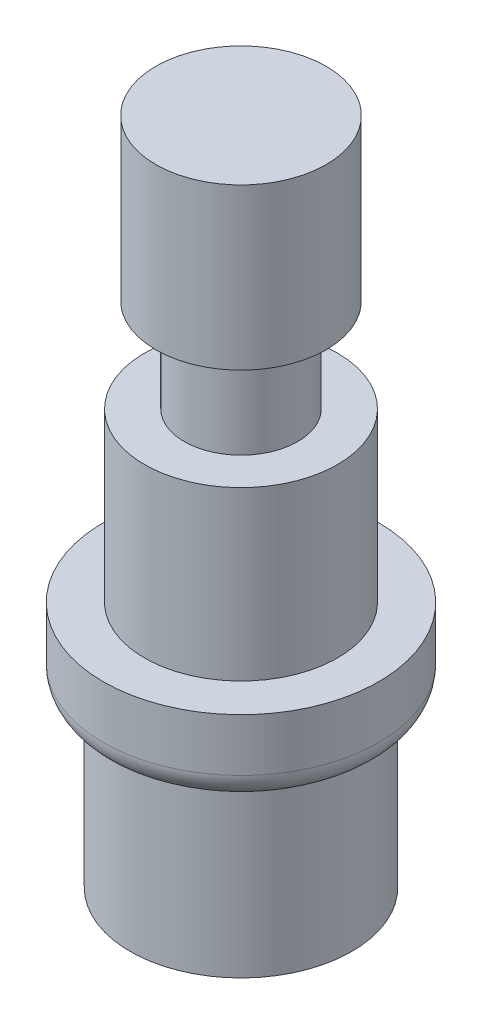
ISO-10303-21;
HEADER;
FILE_DESCRIPTION(('STEP AP214'),'2;1');
FILE_NAME('part.step','',(''),(''),'','','');
FILE_SCHEMA(('AUTOMOTIVE_DESIGN { 1 0 10303 214 1 1 1 1 }'));
ENDSEC;
DATA;
#1=APPLICATION_CONTEXT('core data for automotive mechanical design processes');
#2=APPLICATION_PROTOCOL_DEFINITION('international standard','automotive_design',2000,#1);
#3=PRODUCT_CONTEXT('',#1,'mechanical');
#4=PRODUCT('Part','Part','',(#3));
#5=PRODUCT_RELATED_PRODUCT_CATEGORY('part','',(#4));
#6=PRODUCT_DEFINITION_FORMATION('','',#4);
#7=PRODUCT_DEFINITION_CONTEXT('part definition',#1,'design');
#8=PRODUCT_DEFINITION('design','',#6,#7);
#9=PRODUCT_DEFINITION_SHAPE('','',#8);
#10=(LENGTH_UNIT() NAMED_UNIT(*) SI_UNIT(.MILLI.,.METRE.));
#11=(NAMED_UNIT(*) PLANE_ANGLE_UNIT() SI_UNIT($,.RADIAN.));
#12=(NAMED_UNIT(*) SI_UNIT($,.STERADIAN.) SOLID_ANGLE_UNIT());
#13=UNCERTAINTY_MEASURE_WITH_UNIT(LENGTH_MEASURE(1.E-05),#10,'distance_accuracy_value','');
#14=(GEOMETRIC_REPRESENTATION_CONTEXT(3) GLOBAL_UNCERTAINTY_ASSIGNED_CONTEXT((#13)) GLOBAL_UNIT_ASSIGNED_CONTEXT((#10,
#11,#12)) REPRESENTATION_CONTEXT('',''));
#15=CARTESIAN_POINT('',(0.,0.,0.));
#16=DIRECTION('',(0.,0.,1.));
#17=DIRECTION('',(1.,0.,0.));
#18=AXIS2_PLACEMENT_3D('',#15,#16,#17);
#19=CARTESIAN_POINT('',(0.,23.55,0.));
#20=DIRECTION('',(0.,1.,0.));
#21=DIRECTION('',(0.,0.,1.));
#22=AXIS2_PLACEMENT_3D('',#19,#20,#21);
#23=PLANE('',#22);
#24=CARTESIAN_POINT('',(0.,23.55,0.));
#25=DIRECTION('',(0.,-1.,0.));
#26=DIRECTION('',(0.,0.,-1.));
#27=AXIS2_PLACEMENT_3D('',#24,#25,#26);
#28=CIRCLE('',#27,3.);
#29=CARTESIAN_POINT('',(0.,23.55,-3.));
#30=VERTEX_POINT('',#29);
#31=EDGE_CURVE('E10',#30,#30,#28,.T.);
#32=ORIENTED_EDGE('',*,*,#31,.F.);
#33=EDGE_LOOP('',(#32));
#34=FACE_BOUND('',#33,.T.);
#35=ADVANCED_FACE('F37',(#34),#23,.T.);
#36=CARTESIAN_POINT('',(0.,0.,0.));
#37=DIRECTION('',(0.,-1.,0.));
#38=DIRECTION('',(0.,0.,-1.));
#39=AXIS2_PLACEMENT_3D('',#36,#37,#38);
#40=CYLINDRICAL_SURFACE('',#39,3.);
#41=ORIENTED_EDGE('',*,*,#31,.T.);
#42=EDGE_LOOP('',(#41));
#43=FACE_BOUND('',#42,.T.);
#44=CARTESIAN_POINT('',(0.,17.9,0.));
#45=DIRECTION('',(0.,-1.,0.));
#46=DIRECTION('',(0.,0.,-1.));
#47=AXIS2_PLACEMENT_3D('',#44,#45,#46);
#48=CIRCLE('',#47,3.);
#49=CARTESIAN_POINT('',(0.,17.9,-3.));
#50=VERTEX_POINT('',#49);
#51=EDGE_CURVE('E43',#50,#50,#48,.T.);
#52=ORIENTED_EDGE('',*,*,#51,.F.);
#53=EDGE_LOOP('',(#52));
#54=FACE_BOUND('',#53,.T.);
#55=ADVANCED_FACE('F97',(#43,#54),#40,.T.);
#56=CARTESIAN_POINT('',(3.,17.9,0.));
#57=DIRECTION('',(0.,-1.,0.));
#58=DIRECTION('',(0.,0.,-1.));
#59=AXIS2_PLACEMENT_3D('',#56,#57,#58);
#60=PLANE('',#59);
#61=ORIENTED_EDGE('',*,*,#51,.T.);
#62=EDGE_LOOP('',(#61));
#63=FACE_BOUND('',#62,.T.);
#64=CARTESIAN_POINT('',(0.,17.9,0.));
#65=DIRECTION('',(0.,-1.,0.));
#66=DIRECTION('',(0.,0.,-1.));
#67=AXIS2_PLACEMENT_3D('',#64,#65,#66);
#68=CIRCLE('',#67,2.);
#69=CARTESIAN_POINT('',(0.,17.9,-2.));
#70=VERTEX_POINT('',#69);
#71=EDGE_CURVE('E48',#70,#70,#68,.T.);
#72=ORIENTED_EDGE('',*,*,#71,.F.);
#73=EDGE_LOOP('',(#72));
#74=FACE_BOUND('',#73,.T.);
#75=ADVANCED_FACE('F102',(#63,#74),#60,.T.);
#76=CARTESIAN_POINT('',(0.,0.,0.));
#77=DIRECTION('',(0.,-1.,0.));
#78=DIRECTION('',(0.,0.,-1.));
#79=AXIS2_PLACEMENT_3D('',#76,#77,#78);
#80=CYLINDRICAL_SURFACE('',#79,2.);
#81=ORIENTED_EDGE('',*,*,#71,.T.);
#82=EDGE_LOOP('',(#81));
#83=FACE_BOUND('',#82,.T.);
#84=CARTESIAN_POINT('',(0.,14.6,0.));
#85=DIRECTION('',(0.,-1.,0.));
#86=DIRECTION('',(0.,0.,-1.));
#87=AXIS2_PLACEMENT_3D('',#84,#85,#86);
#88=CIRCLE('',#87,2.);
#89=CARTESIAN_POINT('',(0.,14.6,-2.));
#90=VERTEX_POINT('',#89);
#91=EDGE_CURVE('E54',#90,#90,#88,.T.);
#92=ORIENTED_EDGE('',*,*,#91,.F.);
#93=EDGE_LOOP('',(#92));
#94=FACE_BOUND('',#93,.T.);
#95=ADVANCED_FACE('F106',(#83,#94),#80,.T.);
#96=CARTESIAN_POINT('',(2.,14.6,0.));
#97=DIRECTION('',(0.,1.,0.));
#98=DIRECTION('',(0.,0.,1.));
#99=AXIS2_PLACEMENT_3D('',#96,#97,#98);
#100=PLANE('',#99);
#101=ORIENTED_EDGE('',*,*,#91,.T.);
#102=EDGE_LOOP('',(#101));
#103=FACE_BOUND('',#102,.T.);
#104=CARTESIAN_POINT('',(0.,14.6,0.));
#105=DIRECTION('',(0.,-1.,0.));
#106=DIRECTION('',(0.,0.,-1.));
#107=AXIS2_PLACEMENT_3D('',#104,#105,#106);
#108=CIRCLE('',#107,3.4);
#109=CARTESIAN_POINT('',(0.,14.6,-3.4));
#110=VERTEX_POINT('',#109);
#111=EDGE_CURVE('E60',#110,#110,#108,.T.);
#112=ORIENTED_EDGE('',*,*,#111,.F.);
#113=EDGE_LOOP('',(#112));
#114=FACE_BOUND('',#113,.T.);
#115=ADVANCED_FACE('F112',(#103,#114),#100,.T.);
#116=CARTESIAN_POINT('',(0.,0.,0.));
#117=DIRECTION('',(0.,-1.,0.));
#118=DIRECTION('',(0.,0.,-1.));
#119=AXIS2_PLACEMENT_3D('',#116,#117,#118);
#120=CYLINDRICAL_SURFACE('',#119,3.4);
#121=ORIENTED_EDGE('',*,*,#111,.T.);
#122=EDGE_LOOP('',(#121));
#123=FACE_BOUND('',#122,.T.);
#124=CARTESIAN_POINT('',(0.,8.7,0.));
#125=DIRECTION('',(0.,-1.,0.));
#126=DIRECTION('',(0.,0.,-1.));
#127=AXIS2_PLACEMENT_3D('',#124,#125,#126);
#128=CIRCLE('',#127,3.4);
#129=CARTESIAN_POINT('',(0.,8.7,-3.4));
#130=VERTEX_POINT('',#129);
#131=EDGE_CURVE('E64',#130,#130,#128,.T.);
#132=ORIENTED_EDGE('',*,*,#131,.F.);
#133=EDGE_LOOP('',(#132));
#134=FACE_BOUND('',#133,.T.);
#135=ADVANCED_FACE('F116',(#123,#134),#120,.T.);
#136=CARTESIAN_POINT('',(3.4,8.7,0.));
#137=DIRECTION('',(0.,1.,0.));
#138=DIRECTION('',(0.,0.,1.));
#139=AXIS2_PLACEMENT_3D('',#136,#137,#138);
#140=PLANE('',#139);
#141=ORIENTED_EDGE('',*,*,#131,.T.);
#142=EDGE_LOOP('',(#141));
#143=FACE_BOUND('',#142,.T.);
#144=CARTESIAN_POINT('',(0.,8.7,0.));
#145=DIRECTION('',(0.,-1.,0.));
#146=DIRECTION('',(0.,0.,-1.));
#147=AXIS2_PLACEMENT_3D('',#144,#145,#146);
#148=CIRCLE('',#147,4.85);
#149=CARTESIAN_POINT('',(0.,8.7,-4.85));
#150=VERTEX_POINT('',#149);
#151=EDGE_CURVE('E67',#150,#150,#148,.T.);
#152=ORIENTED_EDGE('',*,*,#151,.F.);
#153=EDGE_LOOP('',(#152));
#154=FACE_BOUND('',#153,.T.);
#155=ADVANCED_FACE('F120',(#143,#154),#140,.T.);
#156=CARTESIAN_POINT('',(0.,0.,0.));
#157=DIRECTION('',(0.,-1.,0.));
#158=DIRECTION('',(0.,0.,-1.));
#159=AXIS2_PLACEMENT_3D('',#156,#157,#158);
#160=CYLINDRICAL_SURFACE('',#159,4.85);
#161=ORIENTED_EDGE('',*,*,#151,.T.);
#162=EDGE_LOOP('',(#161));
#163=FACE_BOUND('',#162,.T.);
#164=CARTESIAN_POINT('',(0.,6.845,0.));
#165=DIRECTION('',(0.,-1.,0.));
#166=DIRECTION('',(0.,0.,-1.));
#167=AXIS2_PLACEMENT_3D('',#164,#165,#166);
#168=CIRCLE('',#167,4.85);
#169=CARTESIAN_POINT('',(0.,6.845,-4.85));
#170=VERTEX_POINT('',#169);
#171=EDGE_CURVE('E71',#170,#170,#168,.T.);
#172=ORIENTED_EDGE('',*,*,#171,.F.);
#173=EDGE_LOOP('',(#172));
#174=FACE_BOUND('',#173,.T.);
#175=ADVANCED_FACE('F93',(#163,#174),#160,.T.);
#176=CARTESIAN_POINT('',(0.,6.845,0.));
#177=DIRECTION('',(0.,-1.,0.));
#178=DIRECTION('',(0.,0.,-1.));
#179=AXIS2_PLACEMENT_3D('',#176,#177,#178);
#180=TOROIDAL_SURFACE('',#179,3.905,0.945);
#181=ORIENTED_EDGE('',*,*,#171,.T.);
#182=EDGE_LOOP('',(#181));
#183=FACE_BOUND('',#182,.T.);
#184=CARTESIAN_POINT('',(0.,5.9,0.));
#185=DIRECTION('',(0.,-1.,0.));
#186=DIRECTION('',(0.,0.,-1.));
#187=AXIS2_PLACEMENT_3D('',#184,#185,#186);
#188=CIRCLE('',#187,3.905);
#189=CARTESIAN_POINT('',(0.,5.9,-3.905));
#190=VERTEX_POINT('',#189);
#191=EDGE_CURVE('E74',#190,#190,#188,.T.);
#192=ORIENTED_EDGE('',*,*,#191,.F.);
#193=EDGE_LOOP('',(#192));
#194=FACE_BOUND('',#193,.T.);
#195=ADVANCED_FACE('F85',(#183,#194),#180,.T.);
#196=CARTESIAN_POINT('',(0.,0.,0.));
#197=DIRECTION('',(0.,-1.,0.));
#198=DIRECTION('',(0.,0.,-1.));
#199=AXIS2_PLACEMENT_3D('',#196,#197,#198);
#200=CYLINDRICAL_SURFACE('',#199,3.905);
#201=ORIENTED_EDGE('',*,*,#191,.T.);
#202=EDGE_LOOP('',(#201));
#203=FACE_BOUND('',#202,.T.);
#204=CARTESIAN_POINT('',(0.,0.,0.));
#205=DIRECTION('',(0.,-1.,0.));
#206=DIRECTION('',(0.,0.,-1.));
#207=AXIS2_PLACEMENT_3D('',#204,#205,#206);
#208=CIRCLE('',#207,3.905);
#209=CARTESIAN_POINT('',(0.,0.,-3.905));
#210=VERTEX_POINT('',#209);
#211=EDGE_CURVE('E77',#210,#210,#208,.T.);
#212=ORIENTED_EDGE('',*,*,#211,.F.);
#213=EDGE_LOOP('',(#212));
#214=FACE_BOUND('',#213,.T.);
#215=ADVANCED_FACE('F83',(#203,#214),#200,.T.);
#216=CARTESIAN_POINT('',(3.905,0.,0.));
#217=DIRECTION('',(0.,-1.,0.));
#218=DIRECTION('',(0.,0.,-1.));
#219=AXIS2_PLACEMENT_3D('',#216,#217,#218);
#220=PLANE('',#219);
#221=ORIENTED_EDGE('',*,*,#211,.T.);
#222=EDGE_LOOP('',(#221));
#223=FACE_BOUND('',#222,.T.);
#224=ADVANCED_FACE('F81',(#223),#220,.T.);
#225=CLOSED_SHELL('',(#35,#55,#75,#95,#115,#135,#155,#175,#195,#215,#224));
#226=MANIFOLD_SOLID_BREP('B2',#225);
#227=ADVANCED_BREP_SHAPE_REPRESENTATION('',(#18,#226),#14);
#228=SHAPE_DEFINITION_REPRESENTATION(#9,#227);
ENDSEC;
END-ISO-10303-21;
